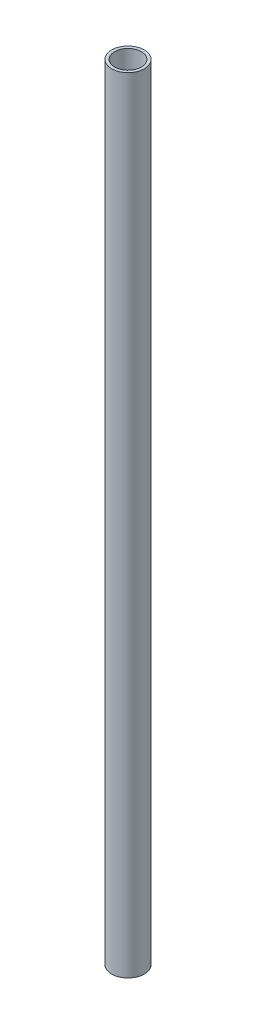
ISO-10303-21;
HEADER;
FILE_DESCRIPTION(('STEP AP214'),'2;1');
FILE_NAME('part.step','',(''),(''),'','','');
FILE_SCHEMA(('AUTOMOTIVE_DESIGN { 1 0 10303 214 1 1 1 1 }'));
ENDSEC;
DATA;
#1=APPLICATION_CONTEXT('core data for automotive mechanical design processes');
#2=APPLICATION_PROTOCOL_DEFINITION('international standard','automotive_design',2000,#1);
#3=PRODUCT_CONTEXT('',#1,'mechanical');
#4=PRODUCT('Part','Part','',(#3));
#5=PRODUCT_RELATED_PRODUCT_CATEGORY('part','',(#4));
#6=PRODUCT_DEFINITION_FORMATION('','',#4);
#7=PRODUCT_DEFINITION_CONTEXT('part definition',#1,'design');
#8=PRODUCT_DEFINITION('design','',#6,#7);
#9=PRODUCT_DEFINITION_SHAPE('','',#8);
#10=(LENGTH_UNIT() NAMED_UNIT(*) SI_UNIT(.MILLI.,.METRE.));
#11=(NAMED_UNIT(*) PLANE_ANGLE_UNIT() SI_UNIT($,.RADIAN.));
#12=(NAMED_UNIT(*) SI_UNIT($,.STERADIAN.) SOLID_ANGLE_UNIT());
#13=UNCERTAINTY_MEASURE_WITH_UNIT(LENGTH_MEASURE(1.E-05),#10,'distance_accuracy_value','');
#14=(GEOMETRIC_REPRESENTATION_CONTEXT(3) GLOBAL_UNCERTAINTY_ASSIGNED_CONTEXT((#13)) GLOBAL_UNIT_ASSIGNED_CONTEXT((#10,
#11,#12)) REPRESENTATION_CONTEXT('',''));
#15=CARTESIAN_POINT('',(0.,0.,0.));
#16=DIRECTION('',(0.,0.,1.));
#17=DIRECTION('',(1.,0.,0.));
#18=AXIS2_PLACEMENT_3D('',#15,#16,#17);
#19=CARTESIAN_POINT('',(0.,609.6,0.));
#20=DIRECTION('',(0.,1.,0.));
#21=DIRECTION('',(0.,0.,1.));
#22=AXIS2_PLACEMENT_3D('',#19,#20,#21);
#23=PLANE('',#22);
#24=CARTESIAN_POINT('',(0.,609.6,0.));
#25=DIRECTION('',(0.,1.,0.));
#26=DIRECTION('',(0.,0.,1.));
#27=AXIS2_PLACEMENT_3D('',#24,#25,#26);
#28=CIRCLE('',#27,12.7);
#29=CARTESIAN_POINT('',(0.,609.6,12.7));
#30=VERTEX_POINT('',#29);
#31=EDGE_CURVE('E10',#30,#30,#28,.T.);
#32=ORIENTED_EDGE('',*,*,#31,.T.);
#33=EDGE_LOOP('',(#32));
#34=FACE_BOUND('',#33,.T.);
#35=CARTESIAN_POINT('',(0.,609.6,0.));
#36=DIRECTION('',(0.,1.,0.));
#37=DIRECTION('',(0.,0.,1.));
#38=AXIS2_PLACEMENT_3D('',#35,#36,#37);
#39=CIRCLE('',#38,10.414);
#40=CARTESIAN_POINT('',(0.,609.6,10.414));
#41=VERTEX_POINT('',#40);
#42=EDGE_CURVE('E42',#41,#41,#39,.T.);
#43=ORIENTED_EDGE('',*,*,#42,.F.);
#44=EDGE_LOOP('',(#43));
#45=FACE_BOUND('',#44,.T.);
#46=ADVANCED_FACE('F31',(#34,#45),#23,.T.);
#47=CARTESIAN_POINT('',(0.,0.,0.));
#48=DIRECTION('',(0.,1.,0.));
#49=DIRECTION('',(0.,0.,1.));
#50=AXIS2_PLACEMENT_3D('',#47,#48,#49);
#51=PLANE('',#50);
#52=CARTESIAN_POINT('',(0.,0.,0.));
#53=DIRECTION('',(0.,1.,0.));
#54=DIRECTION('',(0.,0.,1.));
#55=AXIS2_PLACEMENT_3D('',#52,#53,#54);
#56=CIRCLE('',#55,12.7);
#57=CARTESIAN_POINT('',(0.,0.,12.7));
#58=VERTEX_POINT('',#57);
#59=EDGE_CURVE('E35',#58,#58,#56,.T.);
#60=ORIENTED_EDGE('',*,*,#59,.F.);
#61=EDGE_LOOP('',(#60));
#62=FACE_BOUND('',#61,.T.);
#63=CARTESIAN_POINT('',(0.,0.,0.));
#64=DIRECTION('',(0.,1.,0.));
#65=DIRECTION('',(0.,0.,1.));
#66=AXIS2_PLACEMENT_3D('',#63,#64,#65);
#67=CIRCLE('',#66,10.414);
#68=CARTESIAN_POINT('',(0.,0.,10.414));
#69=VERTEX_POINT('',#68);
#70=EDGE_CURVE('E44',#69,#69,#67,.T.);
#71=ORIENTED_EDGE('',*,*,#70,.T.);
#72=EDGE_LOOP('',(#71));
#73=FACE_BOUND('',#72,.T.);
#74=ADVANCED_FACE('F54',(#62,#73),#51,.F.);
#75=CARTESIAN_POINT('',(0.,609.6,0.));
#76=DIRECTION('',(0.,-1.,0.));
#77=DIRECTION('',(0.,0.,-1.));
#78=AXIS2_PLACEMENT_3D('',#75,#76,#77);
#79=CYLINDRICAL_SURFACE('',#78,12.7);
#80=ORIENTED_EDGE('',*,*,#31,.F.);
#81=EDGE_LOOP('',(#80));
#82=FACE_BOUND('',#81,.T.);
#83=ORIENTED_EDGE('',*,*,#59,.T.);
#84=EDGE_LOOP('',(#83));
#85=FACE_BOUND('',#84,.T.);
#86=ADVANCED_FACE('F33',(#82,#85),#79,.T.);
#87=CARTESIAN_POINT('',(0.,609.6,0.));
#88=DIRECTION('',(0.,-1.,0.));
#89=DIRECTION('',(0.,0.,-1.));
#90=AXIS2_PLACEMENT_3D('',#87,#88,#89);
#91=CYLINDRICAL_SURFACE('',#90,10.414);
#92=ORIENTED_EDGE('',*,*,#42,.T.);
#93=EDGE_LOOP('',(#92));
#94=FACE_BOUND('',#93,.T.);
#95=ORIENTED_EDGE('',*,*,#70,.F.);
#96=EDGE_LOOP('',(#95));
#97=FACE_BOUND('',#96,.T.);
#98=ADVANCED_FACE('F50',(#94,#97),#91,.F.);
#99=CLOSED_SHELL('',(#46,#74,#86,#98));
#100=MANIFOLD_SOLID_BREP('B2',#99);
#101=ADVANCED_BREP_SHAPE_REPRESENTATION('',(#18,#100),#14);
#102=SHAPE_DEFINITION_REPRESENTATION(#9,#101);
ENDSEC;
END-ISO-10303-21;
